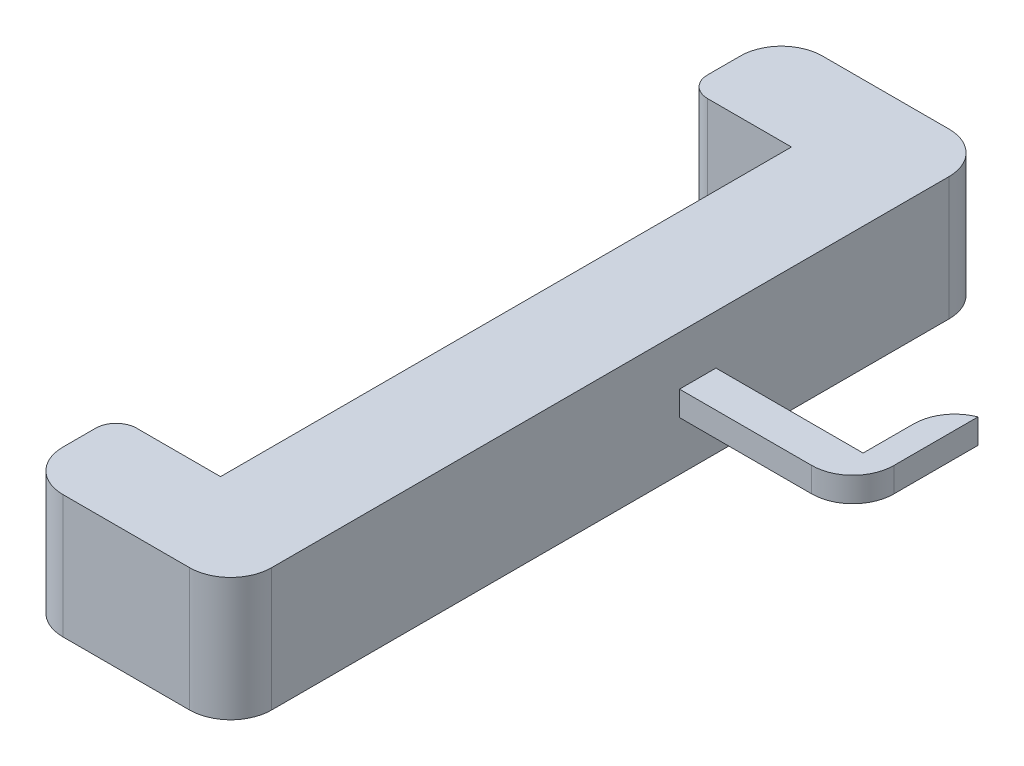
ISO-10303-21;
HEADER;
FILE_DESCRIPTION(('STEP AP214'),'2;1');
FILE_NAME('part.step','',(''),(''),'','','');
FILE_SCHEMA(('AUTOMOTIVE_DESIGN { 1 0 10303 214 1 1 1 1 }'));
ENDSEC;
DATA;
#1=APPLICATION_CONTEXT('core data for automotive mechanical design processes');
#2=APPLICATION_PROTOCOL_DEFINITION('international standard','automotive_design',2000,#1);
#3=PRODUCT_CONTEXT('',#1,'mechanical');
#4=PRODUCT('Part','Part','',(#3));
#5=PRODUCT_RELATED_PRODUCT_CATEGORY('part','',(#4));
#6=PRODUCT_DEFINITION_FORMATION('','',#4);
#7=PRODUCT_DEFINITION_CONTEXT('part definition',#1,'design');
#8=PRODUCT_DEFINITION('design','',#6,#7);
#9=PRODUCT_DEFINITION_SHAPE('','',#8);
#10=(LENGTH_UNIT() NAMED_UNIT(*) SI_UNIT(.MILLI.,.METRE.));
#11=(NAMED_UNIT(*) PLANE_ANGLE_UNIT() SI_UNIT($,.RADIAN.));
#12=(NAMED_UNIT(*) SI_UNIT($,.STERADIAN.) SOLID_ANGLE_UNIT());
#13=UNCERTAINTY_MEASURE_WITH_UNIT(LENGTH_MEASURE(1.E-05),#10,'distance_accuracy_value','');
#14=(GEOMETRIC_REPRESENTATION_CONTEXT(3) GLOBAL_UNCERTAINTY_ASSIGNED_CONTEXT((#13)) GLOBAL_UNIT_ASSIGNED_CONTEXT((#10,
#11,#12)) REPRESENTATION_CONTEXT('',''));
#15=CARTESIAN_POINT('',(0.,0.,0.));
#16=DIRECTION('',(0.,0.,1.));
#17=DIRECTION('',(1.,0.,0.));
#18=AXIS2_PLACEMENT_3D('',#15,#16,#17);
#19=CARTESIAN_POINT('',(-55.9172000230641,-15.,0.));
#20=DIRECTION('',(1.,0.,0.));
#21=DIRECTION('',(0.,0.,-1.));
#22=AXIS2_PLACEMENT_3D('',#19,#20,#21);
#23=PLANE('',#22);
#24=DIRECTION('',(0.,0.,-1.));
#25=VECTOR('',#24,1.);
#26=CARTESIAN_POINT('',(-55.9172000230641,15.,0.));
#27=LINE('',#26,#25);
#28=CARTESIAN_POINT('',(-55.9172000230641,15.,129.682824761905));
#29=VERTEX_POINT('',#28);
#30=CARTESIAN_POINT('',(-55.9172000230641,15.,-35.1257811111111));
#31=VERTEX_POINT('',#30);
#32=EDGE_CURVE('E251',#29,#31,#27,.T.);
#33=ORIENTED_EDGE('',*,*,#32,.F.);
#34=DIRECTION('',(0.,1.,0.));
#35=VECTOR('',#34,1.);
#36=CARTESIAN_POINT('',(-55.9172000230641,-15.,129.682824761905));
#37=LINE('',#36,#35);
#38=CARTESIAN_POINT('',(-55.9172000230641,-15.,129.682824761905));
#39=VERTEX_POINT('',#38);
#40=EDGE_CURVE('E315',#29,#39,#37,.F.);
#41=ORIENTED_EDGE('',*,*,#40,.T.);
#42=DIRECTION('',(0.,0.,-1.));
#43=VECTOR('',#42,1.);
#44=CARTESIAN_POINT('',(-55.9172000230641,-15.,0.));
#45=LINE('',#44,#43);
#46=CARTESIAN_POINT('',(-55.9172000230641,-15.,-35.1257811111111));
#47=VERTEX_POINT('',#46);
#48=EDGE_CURVE('E271',#39,#47,#45,.T.);
#49=ORIENTED_EDGE('',*,*,#48,.T.);
#50=DIRECTION('',(0.,1.,0.));
#51=VECTOR('',#50,1.);
#52=CARTESIAN_POINT('',(-55.9172000230641,-15.,-35.1257811111111));
#53=LINE('',#52,#51);
#54=EDGE_CURVE('E312',#47,#31,#53,.T.);
#55=ORIENTED_EDGE('',*,*,#54,.T.);
#56=EDGE_LOOP('',(#33,#41,#49,#55));
#57=FACE_BOUND('',#56,.T.);
#58=DIRECTION('',(0.,1.,0.));
#59=VECTOR('',#58,1.);
#60=CARTESIAN_POINT('',(-55.9172000230641,-2.99999999999999,21.5914998095238));
#61=LINE('',#60,#59);
#62=CARTESIAN_POINT('',(-55.9172000230641,-2.99999999999999,21.5914998095238));
#63=VERTEX_POINT('',#62);
#64=CARTESIAN_POINT('',(-55.9172000230641,2.99999999999999,21.5914998095238));
#65=VERTEX_POINT('',#64);
#66=EDGE_CURVE('E233',#63,#65,#61,.T.);
#67=ORIENTED_EDGE('',*,*,#66,.F.);
#68=DIRECTION('',(0.,0.,-1.));
#69=VECTOR('',#68,1.);
#70=CARTESIAN_POINT('',(-55.9172000230641,-2.99999999999999,0.));
#71=LINE('',#70,#69);
#72=CARTESIAN_POINT('',(-55.9172000230641,-2.99999999999999,30.4579866666667));
#73=VERTEX_POINT('',#72);
#74=EDGE_CURVE('E204',#73,#63,#71,.T.);
#75=ORIENTED_EDGE('',*,*,#74,.F.);
#76=DIRECTION('',(0.,1.,0.));
#77=VECTOR('',#76,1.);
#78=CARTESIAN_POINT('',(-55.9172000230641,-2.99999999999999,30.4579866666667));
#79=LINE('',#78,#77);
#80=CARTESIAN_POINT('',(-55.9172000230641,2.99999999999999,30.4579866666667));
#81=VERTEX_POINT('',#80);
#82=EDGE_CURVE('E229',#73,#81,#79,.T.);
#83=ORIENTED_EDGE('',*,*,#82,.T.);
#84=DIRECTION('',(0.,0.,-1.));
#85=VECTOR('',#84,1.);
#86=CARTESIAN_POINT('',(-55.9172000230641,2.99999999999999,0.));
#87=LINE('',#86,#85);
#88=EDGE_CURVE('E217',#81,#65,#87,.T.);
#89=ORIENTED_EDGE('',*,*,#88,.T.);
#90=EDGE_LOOP('',(#67,#75,#83,#89));
#91=FACE_BOUND('',#90,.T.);
#92=ADVANCED_FACE('F39',(#57,#91),#23,.T.);
#93=CARTESIAN_POINT('',(-106.717200023064,-15.,0.));
#94=DIRECTION('',(1.,0.,0.));
#95=DIRECTION('',(0.,0.,-1.));
#96=AXIS2_PLACEMENT_3D('',#93,#94,#95);
#97=PLANE('',#96);
#98=DIRECTION('',(0.,0.,-1.));
#99=VECTOR('',#98,1.);
#100=CARTESIAN_POINT('',(-106.717200023064,-15.,0.));
#101=LINE('',#100,#99);
#102=CARTESIAN_POINT('',(-106.717200023064,-15.,-27.1746031746032));
#103=VERTEX_POINT('',#102);
#104=CARTESIAN_POINT('',(-106.717200023064,-15.,-35.1257811111111));
#105=VERTEX_POINT('',#104);
#106=EDGE_CURVE('E257',#103,#105,#101,.T.);
#107=ORIENTED_EDGE('',*,*,#106,.F.);
#108=DIRECTION('',(0.,1.,0.));
#109=VECTOR('',#108,1.);
#110=CARTESIAN_POINT('',(-106.717200023064,-15.,-27.1746031746032));
#111=LINE('',#110,#109);
#112=CARTESIAN_POINT('',(-106.717200023064,15.,-27.1746031746032));
#113=VERTEX_POINT('',#112);
#114=EDGE_CURVE('E47',#103,#113,#111,.T.);
#115=ORIENTED_EDGE('',*,*,#114,.T.);
#116=DIRECTION('',(0.,0.,-1.));
#117=VECTOR('',#116,1.);
#118=CARTESIAN_POINT('',(-106.717200023064,15.,0.));
#119=LINE('',#118,#117);
#120=CARTESIAN_POINT('',(-106.717200023064,15.,-35.1257811111111));
#121=VERTEX_POINT('',#120);
#122=EDGE_CURVE('E232',#113,#121,#119,.T.);
#123=ORIENTED_EDGE('',*,*,#122,.T.);
#124=DIRECTION('',(0.,1.,0.));
#125=VECTOR('',#124,1.);
#126=CARTESIAN_POINT('',(-106.717200023064,-15.,-35.1257811111111));
#127=LINE('',#126,#125);
#128=EDGE_CURVE('E296',#121,#105,#127,.F.);
#129=ORIENTED_EDGE('',*,*,#128,.T.);
#130=EDGE_LOOP('',(#107,#115,#123,#129));
#131=FACE_BOUND('',#130,.T.);
#132=ADVANCED_FACE('F345',(#131),#97,.F.);
#133=CARTESIAN_POINT('',(0.,-15.,-45.1257811111111));
#134=DIRECTION('',(0.,0.,-1.));
#135=DIRECTION('',(-1.,0.,0.));
#136=AXIS2_PLACEMENT_3D('',#133,#134,#135);
#137=PLANE('',#136);
#138=DIRECTION('',(-1.,0.,0.));
#139=VECTOR('',#138,1.);
#140=CARTESIAN_POINT('',(0.,-15.,-45.1257811111111));
#141=LINE('',#140,#139);
#142=CARTESIAN_POINT('',(-65.9172000230641,-15.,-45.1257811111111));
#143=VERTEX_POINT('',#142);
#144=CARTESIAN_POINT('',(-96.7172000230641,-15.,-45.1257811111111));
#145=VERTEX_POINT('',#144);
#146=EDGE_CURVE('E274',#143,#145,#141,.T.);
#147=ORIENTED_EDGE('',*,*,#146,.T.);
#148=DIRECTION('',(0.,1.,0.));
#149=VECTOR('',#148,1.);
#150=CARTESIAN_POINT('',(-96.7172000230641,15.,-45.1257811111111));
#151=LINE('',#150,#149);
#152=CARTESIAN_POINT('',(-96.7172000230641,15.,-45.1257811111111));
#153=VERTEX_POINT('',#152);
#154=EDGE_CURVE('E284',#145,#153,#151,.T.);
#155=ORIENTED_EDGE('',*,*,#154,.T.);
#156=DIRECTION('',(-1.,0.,0.));
#157=VECTOR('',#156,1.);
#158=CARTESIAN_POINT('',(0.,15.,-45.1257811111111));
#159=LINE('',#158,#157);
#160=CARTESIAN_POINT('',(-65.9172000230641,15.,-45.1257811111111));
#161=VERTEX_POINT('',#160);
#162=EDGE_CURVE('E254',#161,#153,#159,.T.);
#163=ORIENTED_EDGE('',*,*,#162,.F.);
#164=DIRECTION('',(0.,1.,0.));
#165=VECTOR('',#164,1.);
#166=CARTESIAN_POINT('',(-65.9172000230641,-15.,-45.1257811111111));
#167=LINE('',#166,#165);
#168=EDGE_CURVE('E281',#161,#143,#167,.F.);
#169=ORIENTED_EDGE('',*,*,#168,.T.);
#170=EDGE_LOOP('',(#147,#155,#163,#169));
#171=FACE_BOUND('',#170,.T.);
#172=ADVANCED_FACE('F361',(#171),#137,.T.);
#173=CARTESIAN_POINT('',(0.,-15.,139.682824761905));
#174=DIRECTION('',(0.,0.,-1.));
#175=DIRECTION('',(-1.,0.,0.));
#176=AXIS2_PLACEMENT_3D('',#173,#174,#175);
#177=PLANE('',#176);
#178=DIRECTION('',(-1.,0.,0.));
#179=VECTOR('',#178,1.);
#180=CARTESIAN_POINT('',(0.,-15.,139.682824761905));
#181=LINE('',#180,#179);
#182=CARTESIAN_POINT('',(-65.9172000230641,-15.,139.682824761905));
#183=VERTEX_POINT('',#182);
#184=CARTESIAN_POINT('',(-96.7172000230641,-15.,139.682824761905));
#185=VERTEX_POINT('',#184);
#186=EDGE_CURVE('E268',#183,#185,#181,.T.);
#187=ORIENTED_EDGE('',*,*,#186,.F.);
#188=DIRECTION('',(0.,1.,0.));
#189=VECTOR('',#188,1.);
#190=CARTESIAN_POINT('',(-65.9172000230641,15.,139.682824761905));
#191=LINE('',#190,#189);
#192=CARTESIAN_POINT('',(-65.9172000230641,15.,139.682824761905));
#193=VERTEX_POINT('',#192);
#194=EDGE_CURVE('E309',#183,#193,#191,.T.);
#195=ORIENTED_EDGE('',*,*,#194,.T.);
#196=DIRECTION('',(-1.,0.,0.));
#197=VECTOR('',#196,1.);
#198=CARTESIAN_POINT('',(0.,15.,139.682824761905));
#199=LINE('',#198,#197);
#200=CARTESIAN_POINT('',(-96.7172000230641,15.,139.682824761905));
#201=VERTEX_POINT('',#200);
#202=EDGE_CURVE('E248',#193,#201,#199,.T.);
#203=ORIENTED_EDGE('',*,*,#202,.T.);
#204=DIRECTION('',(0.,1.,0.));
#205=VECTOR('',#204,1.);
#206=CARTESIAN_POINT('',(-96.7172000230641,-15.,139.682824761905));
#207=LINE('',#206,#205);
#208=EDGE_CURVE('E307',#201,#185,#207,.F.);
#209=ORIENTED_EDGE('',*,*,#208,.T.);
#210=EDGE_LOOP('',(#187,#195,#203,#209));
#211=FACE_BOUND('',#210,.T.);
#212=ADVANCED_FACE('F378',(#211),#177,.F.);
#213=CARTESIAN_POINT('',(-106.717200023064,-15.,0.));
#214=DIRECTION('',(1.,0.,0.));
#215=DIRECTION('',(0.,0.,-1.));
#216=AXIS2_PLACEMENT_3D('',#213,#214,#215);
#217=PLANE('',#216);
#218=DIRECTION('',(0.,0.,-1.));
#219=VECTOR('',#218,1.);
#220=CARTESIAN_POINT('',(-106.717200023064,15.,0.));
#221=LINE('',#220,#219);
#222=CARTESIAN_POINT('',(-106.717200023064,15.,129.682824761905));
#223=VERTEX_POINT('',#222);
#224=CARTESIAN_POINT('',(-106.717200023064,15.,121.731646825397));
#225=VERTEX_POINT('',#224);
#226=EDGE_CURVE('E245',#223,#225,#221,.T.);
#227=ORIENTED_EDGE('',*,*,#226,.T.);
#228=DIRECTION('',(0.,1.,0.));
#229=VECTOR('',#228,1.);
#230=CARTESIAN_POINT('',(-106.717200023064,-15.,121.731646825397));
#231=LINE('',#230,#229);
#232=CARTESIAN_POINT('',(-106.717200023064,-15.,121.731646825397));
#233=VERTEX_POINT('',#232);
#234=EDGE_CURVE('E337',#225,#233,#231,.F.);
#235=ORIENTED_EDGE('',*,*,#234,.T.);
#236=DIRECTION('',(0.,0.,-1.));
#237=VECTOR('',#236,1.);
#238=CARTESIAN_POINT('',(-106.717200023064,-15.,0.));
#239=LINE('',#238,#237);
#240=CARTESIAN_POINT('',(-106.717200023064,-15.,129.682824761905));
#241=VERTEX_POINT('',#240);
#242=EDGE_CURVE('E265',#241,#233,#239,.T.);
#243=ORIENTED_EDGE('',*,*,#242,.F.);
#244=DIRECTION('',(0.,1.,0.));
#245=VECTOR('',#244,1.);
#246=CARTESIAN_POINT('',(-106.717200023064,-15.,129.682824761905));
#247=LINE('',#246,#245);
#248=EDGE_CURVE('E327',#241,#223,#247,.T.);
#249=ORIENTED_EDGE('',*,*,#248,.T.);
#250=EDGE_LOOP('',(#227,#235,#243,#249));
#251=FACE_BOUND('',#250,.T.);
#252=ADVANCED_FACE('F387',(#251),#217,.F.);
#253=CARTESIAN_POINT('',(0.,-15.,116.731646825397));
#254=DIRECTION('',(0.,0.,1.));
#255=DIRECTION('',(1.,0.,0.));
#256=AXIS2_PLACEMENT_3D('',#253,#254,#255);
#257=PLANE('',#256);
#258=DIRECTION('',(1.,0.,0.));
#259=VECTOR('',#258,1.);
#260=CARTESIAN_POINT('',(0.,-15.,116.731646825397));
#261=LINE('',#260,#259);
#262=CARTESIAN_POINT('',(-101.717200023064,-15.,116.731646825397));
#263=VERTEX_POINT('',#262);
#264=CARTESIAN_POINT('',(-81.3172000230641,-15.,116.731646825397));
#265=VERTEX_POINT('',#264);
#266=EDGE_CURVE('E263',#263,#265,#261,.T.);
#267=ORIENTED_EDGE('',*,*,#266,.F.);
#268=DIRECTION('',(0.,1.,0.));
#269=VECTOR('',#268,1.);
#270=CARTESIAN_POINT('',(-101.717200023064,-15.,116.731646825397));
#271=LINE('',#270,#269);
#272=CARTESIAN_POINT('',(-101.717200023064,15.,116.731646825397));
#273=VERTEX_POINT('',#272);
#274=EDGE_CURVE('E330',#263,#273,#271,.T.);
#275=ORIENTED_EDGE('',*,*,#274,.T.);
#276=DIRECTION('',(1.,0.,0.));
#277=VECTOR('',#276,1.);
#278=CARTESIAN_POINT('',(0.,15.,116.731646825397));
#279=LINE('',#278,#277);
#280=CARTESIAN_POINT('',(-81.3172000230641,15.,116.731646825397));
#281=VERTEX_POINT('',#280);
#282=EDGE_CURVE('E243',#273,#281,#279,.T.);
#283=ORIENTED_EDGE('',*,*,#282,.T.);
#284=DIRECTION('',(0.,1.,0.));
#285=VECTOR('',#284,1.);
#286=CARTESIAN_POINT('',(-81.3172000230641,-15.,116.731646825397));
#287=LINE('',#286,#285);
#288=EDGE_CURVE('E278',#265,#281,#287,.T.);
#289=ORIENTED_EDGE('',*,*,#288,.F.);
#290=EDGE_LOOP('',(#267,#275,#283,#289));
#291=FACE_BOUND('',#290,.T.);
#292=ADVANCED_FACE('F396',(#291),#257,.F.);
#293=CARTESIAN_POINT('',(-81.3172000230641,-15.,0.));
#294=DIRECTION('',(1.,0.,0.));
#295=DIRECTION('',(0.,0.,-1.));
#296=AXIS2_PLACEMENT_3D('',#293,#294,#295);
#297=PLANE('',#296);
#298=ORIENTED_EDGE('',*,*,#288,.T.);
#299=DIRECTION('',(0.,0.,-1.));
#300=VECTOR('',#299,1.);
#301=CARTESIAN_POINT('',(-81.3172000230641,15.,0.));
#302=LINE('',#301,#300);
#303=CARTESIAN_POINT('',(-81.3172000230641,15.,-22.1746031746032));
#304=VERTEX_POINT('',#303);
#305=EDGE_CURVE('E240',#281,#304,#302,.T.);
#306=ORIENTED_EDGE('',*,*,#305,.T.);
#307=DIRECTION('',(0.,1.,0.));
#308=VECTOR('',#307,1.);
#309=CARTESIAN_POINT('',(-81.3172000230641,-15.,-22.1746031746032));
#310=LINE('',#309,#308);
#311=CARTESIAN_POINT('',(-81.3172000230641,-15.,-22.1746031746032));
#312=VERTEX_POINT('',#311);
#313=EDGE_CURVE('E277',#312,#304,#310,.T.);
#314=ORIENTED_EDGE('',*,*,#313,.F.);
#315=DIRECTION('',(0.,0.,-1.));
#316=VECTOR('',#315,1.);
#317=CARTESIAN_POINT('',(-81.3172000230641,-15.,0.));
#318=LINE('',#317,#316);
#319=EDGE_CURVE('E261',#265,#312,#318,.T.);
#320=ORIENTED_EDGE('',*,*,#319,.F.);
#321=EDGE_LOOP('',(#298,#306,#314,#320));
#322=FACE_BOUND('',#321,.T.);
#323=ADVANCED_FACE('F401',(#322),#297,.F.);
#324=CARTESIAN_POINT('',(0.,-15.,-22.1746031746032));
#325=DIRECTION('',(0.,0.,-1.));
#326=DIRECTION('',(-1.,0.,0.));
#327=AXIS2_PLACEMENT_3D('',#324,#325,#326);
#328=PLANE('',#327);
#329=DIRECTION('',(-1.,0.,0.));
#330=VECTOR('',#329,1.);
#331=CARTESIAN_POINT('',(0.,15.,-22.1746031746032));
#332=LINE('',#331,#330);
#333=CARTESIAN_POINT('',(-101.717200023064,15.,-22.1746031746032));
#334=VERTEX_POINT('',#333);
#335=EDGE_CURVE('E238',#304,#334,#332,.T.);
#336=ORIENTED_EDGE('',*,*,#335,.T.);
#337=DIRECTION('',(0.,1.,0.));
#338=VECTOR('',#337,1.);
#339=CARTESIAN_POINT('',(-101.717200023064,-15.,-22.1746031746032));
#340=LINE('',#339,#338);
#341=CARTESIAN_POINT('',(-101.717200023064,-15.,-22.1746031746032));
#342=VERTEX_POINT('',#341);
#343=EDGE_CURVE('E11',#334,#342,#340,.F.);
#344=ORIENTED_EDGE('',*,*,#343,.T.);
#345=DIRECTION('',(-1.,0.,0.));
#346=VECTOR('',#345,1.);
#347=CARTESIAN_POINT('',(0.,-15.,-22.1746031746032));
#348=LINE('',#347,#346);
#349=EDGE_CURVE('E259',#312,#342,#348,.T.);
#350=ORIENTED_EDGE('',*,*,#349,.F.);
#351=ORIENTED_EDGE('',*,*,#313,.T.);
#352=EDGE_LOOP('',(#336,#344,#350,#351));
#353=FACE_BOUND('',#352,.T.);
#354=ADVANCED_FACE('F423',(#353),#328,.F.);
#355=CARTESIAN_POINT('',(0.,-15.,0.));
#356=DIRECTION('',(0.,1.,0.));
#357=DIRECTION('',(0.,0.,1.));
#358=AXIS2_PLACEMENT_3D('',#355,#356,#357);
#359=PLANE('',#358);
#360=ORIENTED_EDGE('',*,*,#242,.T.);
#361=CARTESIAN_POINT('',(-101.717200023064,-15.,121.731646825397));
#362=DIRECTION('',(0.,1.,0.));
#363=DIRECTION('',(0.,0.,1.));
#364=AXIS2_PLACEMENT_3D('',#361,#362,#363);
#365=CIRCLE('',#364,5.);
#366=EDGE_CURVE('E340',#233,#263,#365,.F.);
#367=ORIENTED_EDGE('',*,*,#366,.T.);
#368=ORIENTED_EDGE('',*,*,#266,.T.);
#369=ORIENTED_EDGE('',*,*,#319,.T.);
#370=ORIENTED_EDGE('',*,*,#349,.T.);
#371=CARTESIAN_POINT('',(-101.717200023064,-15.,-27.1746031746032));
#372=DIRECTION('',(0.,1.,0.));
#373=DIRECTION('',(0.,0.,1.));
#374=AXIS2_PLACEMENT_3D('',#371,#372,#373);
#375=CIRCLE('',#374,5.);
#376=EDGE_CURVE('E59',#342,#103,#375,.F.);
#377=ORIENTED_EDGE('',*,*,#376,.T.);
#378=ORIENTED_EDGE('',*,*,#106,.T.);
#379=CARTESIAN_POINT('',(-96.7172000230641,-15.,-35.1257811111111));
#380=DIRECTION('',(0.,1.,0.));
#381=DIRECTION('',(0.,0.,1.));
#382=AXIS2_PLACEMENT_3D('',#379,#380,#381);
#383=CIRCLE('',#382,10.);
#384=EDGE_CURVE('E305',#105,#145,#383,.F.);
#385=ORIENTED_EDGE('',*,*,#384,.T.);
#386=ORIENTED_EDGE('',*,*,#146,.F.);
#387=CARTESIAN_POINT('',(-65.9172000230641,-15.,-35.1257811111111));
#388=DIRECTION('',(0.,1.,0.));
#389=DIRECTION('',(0.,0.,1.));
#390=AXIS2_PLACEMENT_3D('',#387,#388,#389);
#391=CIRCLE('',#390,10.);
#392=EDGE_CURVE('E301',#143,#47,#391,.F.);
#393=ORIENTED_EDGE('',*,*,#392,.T.);
#394=ORIENTED_EDGE('',*,*,#48,.F.);
#395=CARTESIAN_POINT('',(-65.9172000230641,-15.,129.682824761905));
#396=DIRECTION('',(0.,1.,0.));
#397=DIRECTION('',(0.,0.,1.));
#398=AXIS2_PLACEMENT_3D('',#395,#396,#397);
#399=CIRCLE('',#398,10.);
#400=EDGE_CURVE('E303',#39,#183,#399,.F.);
#401=ORIENTED_EDGE('',*,*,#400,.T.);
#402=ORIENTED_EDGE('',*,*,#186,.T.);
#403=CARTESIAN_POINT('',(-96.7172000230641,-15.,129.682824761905));
#404=DIRECTION('',(0.,1.,0.));
#405=DIRECTION('',(0.,0.,1.));
#406=AXIS2_PLACEMENT_3D('',#403,#404,#405);
#407=CIRCLE('',#406,10.);
#408=EDGE_CURVE('E299',#185,#241,#407,.F.);
#409=ORIENTED_EDGE('',*,*,#408,.T.);
#410=EDGE_LOOP('',(#360,#367,#368,#369,#370,#377,#378,#385,#386,#393,#394,#401,#402,#409));
#411=FACE_BOUND('',#410,.T.);
#412=ADVANCED_FACE('F358',(#411),#359,.F.);
#413=CARTESIAN_POINT('',(0.,15.,0.));
#414=DIRECTION('',(0.,1.,0.));
#415=DIRECTION('',(0.,0.,1.));
#416=AXIS2_PLACEMENT_3D('',#413,#414,#415);
#417=PLANE('',#416);
#418=ORIENTED_EDGE('',*,*,#282,.F.);
#419=CARTESIAN_POINT('',(-101.717200023064,15.,121.731646825397));
#420=DIRECTION('',(0.,1.,0.));
#421=DIRECTION('',(0.,0.,1.));
#422=AXIS2_PLACEMENT_3D('',#419,#420,#421);
#423=CIRCLE('',#422,5.);
#424=EDGE_CURVE('E335',#273,#225,#423,.T.);
#425=ORIENTED_EDGE('',*,*,#424,.T.);
#426=ORIENTED_EDGE('',*,*,#226,.F.);
#427=CARTESIAN_POINT('',(-96.7172000230641,15.,129.682824761905));
#428=DIRECTION('',(0.,1.,0.));
#429=DIRECTION('',(0.,0.,1.));
#430=AXIS2_PLACEMENT_3D('',#427,#428,#429);
#431=CIRCLE('',#430,10.);
#432=EDGE_CURVE('E287',#223,#201,#431,.T.);
#433=ORIENTED_EDGE('',*,*,#432,.T.);
#434=ORIENTED_EDGE('',*,*,#202,.F.);
#435=CARTESIAN_POINT('',(-65.9172000230641,15.,129.682824761905));
#436=DIRECTION('',(0.,1.,0.));
#437=DIRECTION('',(0.,0.,1.));
#438=AXIS2_PLACEMENT_3D('',#435,#436,#437);
#439=CIRCLE('',#438,10.);
#440=EDGE_CURVE('E291',#193,#29,#439,.T.);
#441=ORIENTED_EDGE('',*,*,#440,.T.);
#442=ORIENTED_EDGE('',*,*,#32,.T.);
#443=CARTESIAN_POINT('',(-65.9172000230641,15.,-35.1257811111111));
#444=DIRECTION('',(0.,1.,0.));
#445=DIRECTION('',(0.,0.,1.));
#446=AXIS2_PLACEMENT_3D('',#443,#444,#445);
#447=CIRCLE('',#446,10.);
#448=EDGE_CURVE('E289',#31,#161,#447,.T.);
#449=ORIENTED_EDGE('',*,*,#448,.T.);
#450=ORIENTED_EDGE('',*,*,#162,.T.);
#451=CARTESIAN_POINT('',(-96.7172000230641,15.,-35.1257811111111));
#452=DIRECTION('',(0.,1.,0.));
#453=DIRECTION('',(0.,0.,1.));
#454=AXIS2_PLACEMENT_3D('',#451,#452,#453);
#455=CIRCLE('',#454,10.);
#456=EDGE_CURVE('E293',#153,#121,#455,.T.);
#457=ORIENTED_EDGE('',*,*,#456,.T.);
#458=ORIENTED_EDGE('',*,*,#122,.F.);
#459=CARTESIAN_POINT('',(-101.717200023064,15.,-27.1746031746032));
#460=DIRECTION('',(0.,1.,0.));
#461=DIRECTION('',(0.,0.,1.));
#462=AXIS2_PLACEMENT_3D('',#459,#460,#461);
#463=CIRCLE('',#462,5.);
#464=EDGE_CURVE('E333',#113,#334,#463,.T.);
#465=ORIENTED_EDGE('',*,*,#464,.T.);
#466=ORIENTED_EDGE('',*,*,#335,.F.);
#467=ORIENTED_EDGE('',*,*,#305,.F.);
#468=EDGE_LOOP('',(#418,#425,#426,#433,#434,#441,#442,#449,#450,#457,#458,#465,#466,#467));
#469=FACE_BOUND('',#468,.T.);
#470=ADVANCED_FACE('F349',(#469),#417,.T.);
#471=CARTESIAN_POINT('',(0.,-2.99999999999999,30.4579866666667));
#472=DIRECTION('',(0.,0.,-1.));
#473=DIRECTION('',(-1.,0.,0.));
#474=AXIS2_PLACEMENT_3D('',#471,#472,#473);
#475=PLANE('',#474);
#476=DIRECTION('',(-1.,0.,0.));
#477=VECTOR('',#476,1.);
#478=CARTESIAN_POINT('',(0.,-2.99999999999999,30.4579866666667));
#479=LINE('',#478,#477);
#480=CARTESIAN_POINT('',(-23.7527000865562,-2.99999999999999,30.4579866666667));
#481=VERTEX_POINT('',#480);
#482=EDGE_CURVE('E219',#481,#73,#479,.T.);
#483=ORIENTED_EDGE('',*,*,#482,.F.);
#484=DIRECTION('',(0.,1.,0.));
#485=VECTOR('',#484,1.);
#486=CARTESIAN_POINT('',(-23.7527000865562,-2.99999999999999,30.4579866666667));
#487=LINE('',#486,#485);
#488=CARTESIAN_POINT('',(-23.7527000865562,2.99999999999999,30.4579866666667));
#489=VERTEX_POINT('',#488);
#490=EDGE_CURVE('E193',#481,#489,#487,.T.);
#491=ORIENTED_EDGE('',*,*,#490,.T.);
#492=DIRECTION('',(-1.,0.,0.));
#493=VECTOR('',#492,1.);
#494=CARTESIAN_POINT('',(0.,2.99999999999999,30.4579866666667));
#495=LINE('',#494,#493);
#496=EDGE_CURVE('E209',#489,#81,#495,.T.);
#497=ORIENTED_EDGE('',*,*,#496,.T.);
#498=ORIENTED_EDGE('',*,*,#82,.F.);
#499=EDGE_LOOP('',(#483,#491,#497,#498));
#500=FACE_BOUND('',#499,.T.);
#501=ADVANCED_FACE('F540',(#500),#475,.F.);
#502=CARTESIAN_POINT('',(0.,-2.99999999999999,21.5914998095238));
#503=DIRECTION('',(0.,0.,1.));
#504=DIRECTION('',(1.,0.,0.));
#505=AXIS2_PLACEMENT_3D('',#502,#503,#504);
#506=PLANE('',#505);
#507=ORIENTED_EDGE('',*,*,#66,.T.);
#508=DIRECTION('',(1.,0.,0.));
#509=VECTOR('',#508,1.);
#510=CARTESIAN_POINT('',(0.,2.99999999999999,21.5914998095238));
#511=LINE('',#510,#509);
#512=CARTESIAN_POINT('',(-20.1134406579847,2.99999999999999,21.5914998095238));
#513=VERTEX_POINT('',#512);
#514=EDGE_CURVE('E211',#65,#513,#511,.T.);
#515=ORIENTED_EDGE('',*,*,#514,.T.);
#516=DIRECTION('',(0.,1.,0.));
#517=VECTOR('',#516,1.);
#518=CARTESIAN_POINT('',(-20.1134406579847,-2.99999999999999,21.5914998095238));
#519=LINE('',#518,#517);
#520=CARTESIAN_POINT('',(-20.1134406579847,-2.99999999999999,21.5914998095238));
#521=VERTEX_POINT('',#520);
#522=EDGE_CURVE('E203',#521,#513,#519,.T.);
#523=ORIENTED_EDGE('',*,*,#522,.F.);
#524=DIRECTION('',(1.,0.,0.));
#525=VECTOR('',#524,1.);
#526=CARTESIAN_POINT('',(0.,-2.99999999999999,21.5914998095238));
#527=LINE('',#526,#525);
#528=EDGE_CURVE('E225',#63,#521,#527,.T.);
#529=ORIENTED_EDGE('',*,*,#528,.F.);
#530=EDGE_LOOP('',(#507,#515,#523,#529));
#531=FACE_BOUND('',#530,.T.);
#532=ADVANCED_FACE('F530',(#531),#506,.F.);
#533=CARTESIAN_POINT('',(-20.1134406579847,-2.99999999999999,0.));
#534=DIRECTION('',(1.,0.,0.));
#535=DIRECTION('',(0.,0.,-1.));
#536=AXIS2_PLACEMENT_3D('',#533,#534,#535);
#537=PLANE('',#536);
#538=DIRECTION('',(0.,0.,-1.));
#539=VECTOR('',#538,1.);
#540=CARTESIAN_POINT('',(-20.1134406579847,2.99999999999999,0.));
#541=LINE('',#540,#539);
#542=CARTESIAN_POINT('',(-20.1134406579847,2.99999999999999,9.31427886696301));
#543=VERTEX_POINT('',#542);
#544=EDGE_CURVE('E208',#513,#543,#541,.T.);
#545=ORIENTED_EDGE('',*,*,#544,.T.);
#546=DIRECTION('',(0.,-1.,0.));
#547=VECTOR('',#546,1.);
#548=CARTESIAN_POINT('',(-20.1134406579847,-2.99999999999999,9.31427886696301));
#549=LINE('',#548,#547);
#550=CARTESIAN_POINT('',(-20.1134406579847,-2.99999999999999,9.31427886696301));
#551=VERTEX_POINT('',#550);
#552=EDGE_CURVE('E187',#543,#551,#549,.T.);
#553=ORIENTED_EDGE('',*,*,#552,.T.);
#554=DIRECTION('',(0.,0.,-1.));
#555=VECTOR('',#554,1.);
#556=CARTESIAN_POINT('',(-20.1134406579847,-2.99999999999999,0.));
#557=LINE('',#556,#555);
#558=EDGE_CURVE('E222',#521,#551,#557,.T.);
#559=ORIENTED_EDGE('',*,*,#558,.F.);
#560=ORIENTED_EDGE('',*,*,#522,.T.);
#561=EDGE_LOOP('',(#545,#553,#559,#560));
#562=FACE_BOUND('',#561,.T.);
#563=ADVANCED_FACE('F521',(#562),#537,.F.);
#564=CARTESIAN_POINT('',(-13.7527000865562,-2.99999999999999,0.));
#565=DIRECTION('',(-1.,0.,0.));
#566=DIRECTION('',(0.,0.,1.));
#567=AXIS2_PLACEMENT_3D('',#564,#565,#566);
#568=PLANE('',#567);
#569=DIRECTION('',(0.,0.,1.));
#570=VECTOR('',#569,1.);
#571=CARTESIAN_POINT('',(-13.7527000865562,2.99999999999999,0.));
#572=LINE('',#571,#570);
#573=CARTESIAN_POINT('',(-13.7527000865562,2.99999999999999,0.));
#574=VERTEX_POINT('',#573);
#575=CARTESIAN_POINT('',(-13.7527000865562,2.99999999999999,20.4579866666667));
#576=VERTEX_POINT('',#575);
#577=EDGE_CURVE('E199',#574,#576,#572,.T.);
#578=ORIENTED_EDGE('',*,*,#577,.T.);
#579=DIRECTION('',(0.,1.,0.));
#580=VECTOR('',#579,1.);
#581=CARTESIAN_POINT('',(-13.7527000865562,-2.99999999999999,20.4579866666667));
#582=LINE('',#581,#580);
#583=CARTESIAN_POINT('',(-13.7527000865562,-2.99999999999999,20.4579866666667));
#584=VERTEX_POINT('',#583);
#585=EDGE_CURVE('E320',#576,#584,#582,.F.);
#586=ORIENTED_EDGE('',*,*,#585,.T.);
#587=DIRECTION('',(0.,0.,1.));
#588=VECTOR('',#587,1.);
#589=CARTESIAN_POINT('',(-13.7527000865562,-2.99999999999999,0.));
#590=LINE('',#589,#588);
#591=CARTESIAN_POINT('',(-13.7527000865562,-2.99999999999999,0.));
#592=VERTEX_POINT('',#591);
#593=EDGE_CURVE('E202',#592,#584,#590,.T.);
#594=ORIENTED_EDGE('',*,*,#593,.F.);
#595=DIRECTION('',(0.,1.,0.));
#596=VECTOR('',#595,1.);
#597=CARTESIAN_POINT('',(-13.7527000865562,-2.99999999999999,0.));
#598=LINE('',#597,#596);
#599=EDGE_CURVE('E186',#592,#574,#598,.T.);
#600=ORIENTED_EDGE('',*,*,#599,.T.);
#601=EDGE_LOOP('',(#578,#586,#594,#600));
#602=FACE_BOUND('',#601,.T.);
#603=ADVANCED_FACE('F198',(#602),#568,.F.);
#604=CARTESIAN_POINT('',(0.,-2.99999999999999,0.));
#605=DIRECTION('',(0.,1.,0.));
#606=DIRECTION('',(0.,0.,1.));
#607=AXIS2_PLACEMENT_3D('',#604,#605,#606);
#608=PLANE('',#607);
#609=ORIENTED_EDGE('',*,*,#593,.T.);
#610=CARTESIAN_POINT('',(-23.7527000865562,-2.99999999999999,20.4579866666667));
#611=DIRECTION('',(0.,1.,0.));
#612=DIRECTION('',(0.,0.,1.));
#613=AXIS2_PLACEMENT_3D('',#610,#611,#612);
#614=CIRCLE('',#613,10.);
#615=EDGE_CURVE('E324',#584,#481,#614,.F.);
#616=ORIENTED_EDGE('',*,*,#615,.T.);
#617=ORIENTED_EDGE('',*,*,#482,.T.);
#618=ORIENTED_EDGE('',*,*,#74,.T.);
#619=ORIENTED_EDGE('',*,*,#528,.T.);
#620=ORIENTED_EDGE('',*,*,#558,.T.);
#621=CARTESIAN_POINT('',(-10.1134406579847,-2.99999999999999,9.31427886696301));
#622=DIRECTION('',(0.,1.,0.));
#623=DIRECTION('',(0.,0.,1.));
#624=AXIS2_PLACEMENT_3D('',#621,#622,#623);
#625=CIRCLE('',#624,10.);
#626=EDGE_CURVE('E322',#551,#592,#625,.F.);
#627=ORIENTED_EDGE('',*,*,#626,.T.);
#628=EDGE_LOOP('',(#609,#616,#617,#618,#619,#620,#627));
#629=FACE_BOUND('',#628,.T.);
#630=ADVANCED_FACE('F503',(#629),#608,.F.);
#631=CARTESIAN_POINT('',(0.,2.99999999999999,0.));
#632=DIRECTION('',(0.,1.,0.));
#633=DIRECTION('',(0.,0.,1.));
#634=AXIS2_PLACEMENT_3D('',#631,#632,#633);
#635=PLANE('',#634);
#636=ORIENTED_EDGE('',*,*,#496,.F.);
#637=CARTESIAN_POINT('',(-23.7527000865562,2.99999999999999,20.4579866666667));
#638=DIRECTION('',(0.,1.,0.));
#639=DIRECTION('',(0.,0.,1.));
#640=AXIS2_PLACEMENT_3D('',#637,#638,#639);
#641=CIRCLE('',#640,10.);
#642=EDGE_CURVE('E192',#489,#576,#641,.T.);
#643=ORIENTED_EDGE('',*,*,#642,.T.);
#644=ORIENTED_EDGE('',*,*,#577,.F.);
#645=CARTESIAN_POINT('',(-10.1134406579847,2.99999999999999,9.31427886696301));
#646=DIRECTION('',(0.,1.,0.));
#647=DIRECTION('',(0.,0.,1.));
#648=AXIS2_PLACEMENT_3D('',#645,#646,#647);
#649=CIRCLE('',#648,10.);
#650=EDGE_CURVE('E182',#574,#543,#649,.T.);
#651=ORIENTED_EDGE('',*,*,#650,.T.);
#652=ORIENTED_EDGE('',*,*,#544,.F.);
#653=ORIENTED_EDGE('',*,*,#514,.F.);
#654=ORIENTED_EDGE('',*,*,#88,.F.);
#655=EDGE_LOOP('',(#636,#643,#644,#651,#652,#653,#654));
#656=FACE_BOUND('',#655,.T.);
#657=ADVANCED_FACE('F207',(#656),#635,.T.);
#658=CARTESIAN_POINT('',(-96.7172000230641,-15.,-35.1257811111111));
#659=DIRECTION('',(0.,-1.,0.));
#660=DIRECTION('',(0.,0.,-1.));
#661=AXIS2_PLACEMENT_3D('',#658,#659,#660);
#662=CYLINDRICAL_SURFACE('',#661,10.);
#663=ORIENTED_EDGE('',*,*,#384,.F.);
#664=ORIENTED_EDGE('',*,*,#128,.F.);
#665=ORIENTED_EDGE('',*,*,#456,.F.);
#666=ORIENTED_EDGE('',*,*,#154,.F.);
#667=EDGE_LOOP('',(#663,#664,#665,#666));
#668=FACE_BOUND('',#667,.T.);
#669=ADVANCED_FACE('F356',(#668),#662,.T.);
#670=CARTESIAN_POINT('',(-65.9172000230641,-15.,129.682824761905));
#671=DIRECTION('',(0.,-1.,0.));
#672=DIRECTION('',(0.,0.,-1.));
#673=AXIS2_PLACEMENT_3D('',#670,#671,#672);
#674=CYLINDRICAL_SURFACE('',#673,10.);
#675=ORIENTED_EDGE('',*,*,#400,.F.);
#676=ORIENTED_EDGE('',*,*,#40,.F.);
#677=ORIENTED_EDGE('',*,*,#440,.F.);
#678=ORIENTED_EDGE('',*,*,#194,.F.);
#679=EDGE_LOOP('',(#675,#676,#677,#678));
#680=FACE_BOUND('',#679,.T.);
#681=ADVANCED_FACE('F373',(#680),#674,.T.);
#682=CARTESIAN_POINT('',(-23.7527000865562,-2.99999999999999,20.4579866666667));
#683=DIRECTION('',(0.,1.,0.));
#684=DIRECTION('',(0.,0.,1.));
#685=AXIS2_PLACEMENT_3D('',#682,#683,#684);
#686=CYLINDRICAL_SURFACE('',#685,10.);
#687=ORIENTED_EDGE('',*,*,#615,.F.);
#688=ORIENTED_EDGE('',*,*,#585,.F.);
#689=ORIENTED_EDGE('',*,*,#642,.F.);
#690=ORIENTED_EDGE('',*,*,#490,.F.);
#691=EDGE_LOOP('',(#687,#688,#689,#690));
#692=FACE_BOUND('',#691,.T.);
#693=ADVANCED_FACE('F430',(#692),#686,.T.);
#694=CARTESIAN_POINT('',(-10.1134406579847,-2.99999999999999,9.31427886696301));
#695=DIRECTION('',(0.,-1.,0.));
#696=DIRECTION('',(0.,0.,-1.));
#697=AXIS2_PLACEMENT_3D('',#694,#695,#696);
#698=CYLINDRICAL_SURFACE('',#697,10.);
#699=ORIENTED_EDGE('',*,*,#626,.F.);
#700=ORIENTED_EDGE('',*,*,#552,.F.);
#701=ORIENTED_EDGE('',*,*,#650,.F.);
#702=ORIENTED_EDGE('',*,*,#599,.F.);
#703=EDGE_LOOP('',(#699,#700,#701,#702));
#704=FACE_BOUND('',#703,.T.);
#705=ADVANCED_FACE('F185',(#704),#698,.T.);
#706=CARTESIAN_POINT('',(-65.9172000230641,-15.,-35.1257811111111));
#707=DIRECTION('',(0.,1.,0.));
#708=DIRECTION('',(0.,0.,1.));
#709=AXIS2_PLACEMENT_3D('',#706,#707,#708);
#710=CYLINDRICAL_SURFACE('',#709,10.);
#711=ORIENTED_EDGE('',*,*,#392,.F.);
#712=ORIENTED_EDGE('',*,*,#168,.F.);
#713=ORIENTED_EDGE('',*,*,#448,.F.);
#714=ORIENTED_EDGE('',*,*,#54,.F.);
#715=EDGE_LOOP('',(#711,#712,#713,#714));
#716=FACE_BOUND('',#715,.T.);
#717=ADVANCED_FACE('F364',(#716),#710,.T.);
#718=CARTESIAN_POINT('',(-96.7172000230641,-15.,129.682824761905));
#719=DIRECTION('',(0.,1.,0.));
#720=DIRECTION('',(0.,0.,1.));
#721=AXIS2_PLACEMENT_3D('',#718,#719,#720);
#722=CYLINDRICAL_SURFACE('',#721,10.);
#723=ORIENTED_EDGE('',*,*,#408,.F.);
#724=ORIENTED_EDGE('',*,*,#208,.F.);
#725=ORIENTED_EDGE('',*,*,#432,.F.);
#726=ORIENTED_EDGE('',*,*,#248,.F.);
#727=EDGE_LOOP('',(#723,#724,#725,#726));
#728=FACE_BOUND('',#727,.T.);
#729=ADVANCED_FACE('F382',(#728),#722,.T.);
#730=CARTESIAN_POINT('',(-101.717200023064,-15.,121.731646825397));
#731=DIRECTION('',(0.,1.,0.));
#732=DIRECTION('',(0.,0.,1.));
#733=AXIS2_PLACEMENT_3D('',#730,#731,#732);
#734=CYLINDRICAL_SURFACE('',#733,5.);
#735=ORIENTED_EDGE('',*,*,#366,.F.);
#736=ORIENTED_EDGE('',*,*,#234,.F.);
#737=ORIENTED_EDGE('',*,*,#424,.F.);
#738=ORIENTED_EDGE('',*,*,#274,.F.);
#739=EDGE_LOOP('',(#735,#736,#737,#738));
#740=FACE_BOUND('',#739,.T.);
#741=ADVANCED_FACE('F391',(#740),#734,.T.);
#742=CARTESIAN_POINT('',(-101.717200023064,-15.,-27.1746031746032));
#743=DIRECTION('',(0.,1.,0.));
#744=DIRECTION('',(0.,0.,1.));
#745=AXIS2_PLACEMENT_3D('',#742,#743,#744);
#746=CYLINDRICAL_SURFACE('',#745,5.);
#747=ORIENTED_EDGE('',*,*,#376,.F.);
#748=ORIENTED_EDGE('',*,*,#343,.F.);
#749=ORIENTED_EDGE('',*,*,#464,.F.);
#750=ORIENTED_EDGE('',*,*,#114,.F.);
#751=EDGE_LOOP('',(#747,#748,#749,#750));
#752=FACE_BOUND('',#751,.T.);
#753=ADVANCED_FACE('F41',(#752),#746,.T.);
#754=CLOSED_SHELL('',(#92,#132,#172,#212,#252,#292,#323,#354,#412,#470,#501,#532,#563,#603,#630,
#657,#669,#681,#693,#705,#717,#729,#741,#753));
#755=MANIFOLD_SOLID_BREP('B2',#754);
#756=ADVANCED_BREP_SHAPE_REPRESENTATION('',(#18,#755),#14);
#757=SHAPE_DEFINITION_REPRESENTATION(#9,#756);
ENDSEC;
END-ISO-10303-21;
